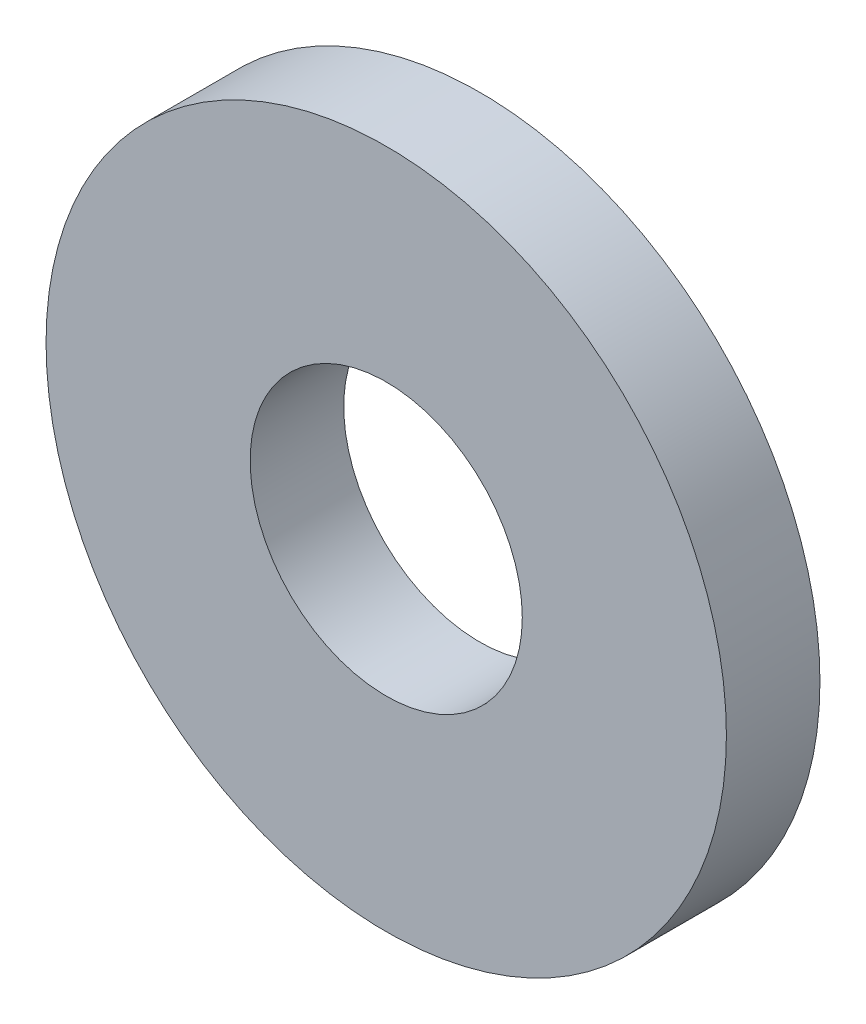
ISO-10303-21;
HEADER;
FILE_DESCRIPTION(('STEP AP214'),'2;1');
FILE_NAME('part.step','',(''),(''),'','','');
FILE_SCHEMA(('AUTOMOTIVE_DESIGN { 1 0 10303 214 1 1 1 1 }'));
ENDSEC;
DATA;
#1=APPLICATION_CONTEXT('core data for automotive mechanical design processes');
#2=APPLICATION_PROTOCOL_DEFINITION('international standard','automotive_design',2000,#1);
#3=PRODUCT_CONTEXT('',#1,'mechanical');
#4=PRODUCT('Part','Part','',(#3));
#5=PRODUCT_RELATED_PRODUCT_CATEGORY('part','',(#4));
#6=PRODUCT_DEFINITION_FORMATION('','',#4);
#7=PRODUCT_DEFINITION_CONTEXT('part definition',#1,'design');
#8=PRODUCT_DEFINITION('design','',#6,#7);
#9=PRODUCT_DEFINITION_SHAPE('','',#8);
#10=(LENGTH_UNIT() NAMED_UNIT(*) SI_UNIT(.MILLI.,.METRE.));
#11=(NAMED_UNIT(*) PLANE_ANGLE_UNIT() SI_UNIT($,.RADIAN.));
#12=(NAMED_UNIT(*) SI_UNIT($,.STERADIAN.) SOLID_ANGLE_UNIT());
#13=UNCERTAINTY_MEASURE_WITH_UNIT(LENGTH_MEASURE(1.E-05),#10,'distance_accuracy_value','');
#14=(GEOMETRIC_REPRESENTATION_CONTEXT(3) GLOBAL_UNCERTAINTY_ASSIGNED_CONTEXT((#13)) GLOBAL_UNIT_ASSIGNED_CONTEXT((#10,
#11,#12)) REPRESENTATION_CONTEXT('',''));
#15=CARTESIAN_POINT('',(0.,0.,0.));
#16=DIRECTION('',(0.,0.,1.));
#17=DIRECTION('',(1.,0.,0.));
#18=AXIS2_PLACEMENT_3D('',#15,#16,#17);
#19=CARTESIAN_POINT('',(0.,0.,1.1));
#20=DIRECTION('',(0.,0.,1.));
#21=DIRECTION('',(1.,0.,0.));
#22=AXIS2_PLACEMENT_3D('',#19,#20,#21);
#23=PLANE('',#22);
#24=CARTESIAN_POINT('',(0.,0.,1.1));
#25=DIRECTION('',(0.,0.,1.));
#26=DIRECTION('',(1.,0.,0.));
#27=AXIS2_PLACEMENT_3D('',#24,#25,#26);
#28=CIRCLE('',#27,4.);
#29=CARTESIAN_POINT('',(4.,0.,1.1));
#30=VERTEX_POINT('',#29);
#31=EDGE_CURVE('E10',#30,#30,#28,.T.);
#32=ORIENTED_EDGE('',*,*,#31,.T.);
#33=EDGE_LOOP('',(#32));
#34=FACE_BOUND('',#33,.T.);
#35=CARTESIAN_POINT('',(0.,0.,1.1));
#36=DIRECTION('',(0.,0.,1.));
#37=DIRECTION('',(1.,0.,0.));
#38=AXIS2_PLACEMENT_3D('',#35,#36,#37);
#39=CIRCLE('',#38,1.6);
#40=CARTESIAN_POINT('',(1.6,0.,1.1));
#41=VERTEX_POINT('',#40);
#42=EDGE_CURVE('E44',#41,#41,#39,.T.);
#43=ORIENTED_EDGE('',*,*,#42,.F.);
#44=EDGE_LOOP('',(#43));
#45=FACE_BOUND('',#44,.T.);
#46=ADVANCED_FACE('F33',(#34,#45),#23,.T.);
#47=CARTESIAN_POINT('',(0.,0.,0.));
#48=DIRECTION('',(0.,0.,1.));
#49=DIRECTION('',(1.,0.,0.));
#50=AXIS2_PLACEMENT_3D('',#47,#48,#49);
#51=PLANE('',#50);
#52=CARTESIAN_POINT('',(0.,0.,0.));
#53=DIRECTION('',(0.,0.,1.));
#54=DIRECTION('',(1.,0.,0.));
#55=AXIS2_PLACEMENT_3D('',#52,#53,#54);
#56=CIRCLE('',#55,4.);
#57=CARTESIAN_POINT('',(4.,0.,0.));
#58=VERTEX_POINT('',#57);
#59=EDGE_CURVE('E37',#58,#58,#56,.T.);
#60=ORIENTED_EDGE('',*,*,#59,.F.);
#61=EDGE_LOOP('',(#60));
#62=FACE_BOUND('',#61,.T.);
#63=CARTESIAN_POINT('',(0.,0.,0.));
#64=DIRECTION('',(0.,0.,1.));
#65=DIRECTION('',(1.,0.,0.));
#66=AXIS2_PLACEMENT_3D('',#63,#64,#65);
#67=CIRCLE('',#66,1.6);
#68=CARTESIAN_POINT('',(1.6,0.,0.));
#69=VERTEX_POINT('',#68);
#70=EDGE_CURVE('E46',#69,#69,#67,.T.);
#71=ORIENTED_EDGE('',*,*,#70,.T.);
#72=EDGE_LOOP('',(#71));
#73=FACE_BOUND('',#72,.T.);
#74=ADVANCED_FACE('F56',(#62,#73),#51,.F.);
#75=CARTESIAN_POINT('',(0.,0.,1.1));
#76=DIRECTION('',(0.,0.,-1.));
#77=DIRECTION('',(-1.,0.,0.));
#78=AXIS2_PLACEMENT_3D('',#75,#76,#77);
#79=CYLINDRICAL_SURFACE('',#78,4.);
#80=ORIENTED_EDGE('',*,*,#31,.F.);
#81=EDGE_LOOP('',(#80));
#82=FACE_BOUND('',#81,.T.);
#83=ORIENTED_EDGE('',*,*,#59,.T.);
#84=EDGE_LOOP('',(#83));
#85=FACE_BOUND('',#84,.T.);
#86=ADVANCED_FACE('F35',(#82,#85),#79,.T.);
#87=CARTESIAN_POINT('',(0.,0.,1.1));
#88=DIRECTION('',(0.,0.,-1.));
#89=DIRECTION('',(-1.,0.,0.));
#90=AXIS2_PLACEMENT_3D('',#87,#88,#89);
#91=CYLINDRICAL_SURFACE('',#90,1.6);
#92=ORIENTED_EDGE('',*,*,#42,.T.);
#93=EDGE_LOOP('',(#92));
#94=FACE_BOUND('',#93,.T.);
#95=ORIENTED_EDGE('',*,*,#70,.F.);
#96=EDGE_LOOP('',(#95));
#97=FACE_BOUND('',#96,.T.);
#98=ADVANCED_FACE('F52',(#94,#97),#91,.F.);
#99=CLOSED_SHELL('',(#46,#74,#86,#98));
#100=MANIFOLD_SOLID_BREP('B2',#99);
#101=ADVANCED_BREP_SHAPE_REPRESENTATION('',(#18,#100),#14);
#102=SHAPE_DEFINITION_REPRESENTATION(#9,#101);
ENDSEC;
END-ISO-10303-21;
